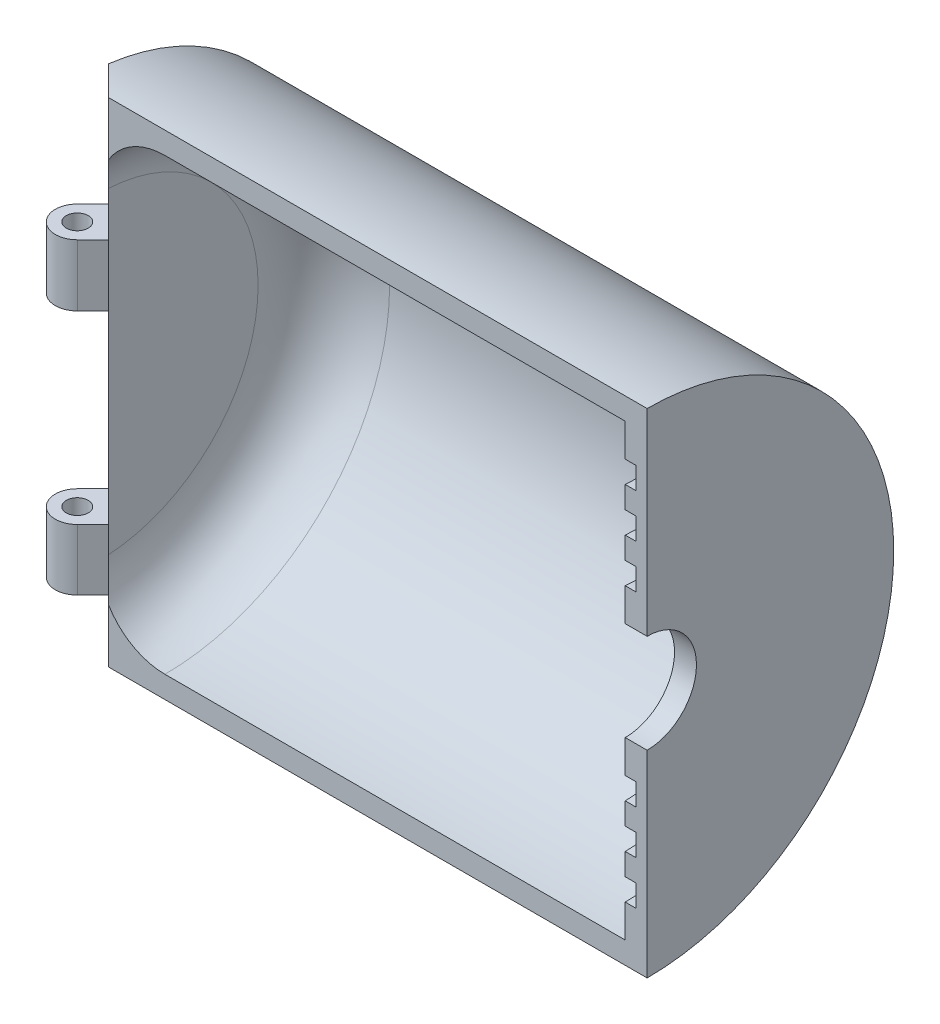
ISO-10303-21;
HEADER;
FILE_DESCRIPTION(('STEP AP214'),'2;1');
FILE_NAME('part.step','',(''),(''),'','','');
FILE_SCHEMA(('AUTOMOTIVE_DESIGN { 1 0 10303 214 1 1 1 1 }'));
ENDSEC;
DATA;
#1=APPLICATION_CONTEXT('core data for automotive mechanical design processes');
#2=APPLICATION_PROTOCOL_DEFINITION('international standard','automotive_design',2000,#1);
#3=PRODUCT_CONTEXT('',#1,'mechanical');
#4=PRODUCT('Part','Part','',(#3));
#5=PRODUCT_RELATED_PRODUCT_CATEGORY('part','',(#4));
#6=PRODUCT_DEFINITION_FORMATION('','',#4);
#7=PRODUCT_DEFINITION_CONTEXT('part definition',#1,'design');
#8=PRODUCT_DEFINITION('design','',#6,#7);
#9=PRODUCT_DEFINITION_SHAPE('','',#8);
#10=(LENGTH_UNIT() NAMED_UNIT(*) SI_UNIT(.MILLI.,.METRE.));
#11=(NAMED_UNIT(*) PLANE_ANGLE_UNIT() SI_UNIT($,.RADIAN.));
#12=(NAMED_UNIT(*) SI_UNIT($,.STERADIAN.) SOLID_ANGLE_UNIT());
#13=UNCERTAINTY_MEASURE_WITH_UNIT(LENGTH_MEASURE(1.E-05),#10,'distance_accuracy_value','');
#14=(GEOMETRIC_REPRESENTATION_CONTEXT(3) GLOBAL_UNCERTAINTY_ASSIGNED_CONTEXT((#13)) GLOBAL_UNIT_ASSIGNED_CONTEXT((#10,
#11,#12)) REPRESENTATION_CONTEXT('',''));
#15=CARTESIAN_POINT('',(0.,0.,0.));
#16=DIRECTION('',(0.,0.,1.));
#17=DIRECTION('',(1.,0.,0.));
#18=AXIS2_PLACEMENT_3D('',#15,#16,#17);
#19=CARTESIAN_POINT('',(-24.2928932188134,-11.25,0.707106781186545));
#20=DIRECTION('',(0.707106781186552,0.,0.707106781186543));
#21=DIRECTION('',(0.707106781186543,0.,-0.707106781186552));
#22=AXIS2_PLACEMENT_3D('',#19,#20,#21);
#23=PLANE('',#22);
#24=DIRECTION('',(-0.707106781186543,0.,0.707106781186552));
#25=VECTOR('',#24,1.);
#26=CARTESIAN_POINT('',(-23.5857864376269,-8.41492963527557,0.));
#27=LINE('',#26,#25);
#28=CARTESIAN_POINT('',(-23.5857864376269,-8.41492963527557,0.));
#29=VERTEX_POINT('',#28);
#30=CARTESIAN_POINT('',(-24.2928932188134,-8.41492963527557,0.707106781186551));
#31=VERTEX_POINT('',#30);
#32=EDGE_CURVE('E593',#29,#31,#27,.T.);
#33=ORIENTED_EDGE('',*,*,#32,.F.);
#34=DIRECTION('',(0.,1.,0.));
#35=VECTOR('',#34,1.);
#36=CARTESIAN_POINT('',(-23.5857864376269,-11.25,0.));
#37=LINE('',#36,#35);
#38=CARTESIAN_POINT('',(-23.5857864376269,-5.625,0.));
#39=VERTEX_POINT('',#38);
#40=EDGE_CURVE('E337',#29,#39,#37,.T.);
#41=ORIENTED_EDGE('',*,*,#40,.T.);
#42=DIRECTION('',(0.707106781186544,0.,-0.707106781186551));
#43=VECTOR('',#42,1.);
#44=CARTESIAN_POINT('',(-23.5857864376269,-5.625,0.));
#45=LINE('',#44,#43);
#46=CARTESIAN_POINT('',(-24.2928932188134,-5.625,0.70710678118655));
#47=VERTEX_POINT('',#46);
#48=EDGE_CURVE('E613',#47,#39,#45,.T.);
#49=ORIENTED_EDGE('',*,*,#48,.F.);
#50=DIRECTION('',(0.,1.,0.));
#51=VECTOR('',#50,1.);
#52=CARTESIAN_POINT('',(-24.2928932188134,-11.25,0.707106781186547));
#53=LINE('',#52,#51);
#54=EDGE_CURVE('E597',#31,#47,#53,.T.);
#55=ORIENTED_EDGE('',*,*,#54,.F.);
#56=EDGE_LOOP('',(#33,#41,#49,#55));
#57=FACE_BOUND('',#56,.T.);
#58=ADVANCED_FACE('F107',(#57),#23,.T.);
#59=CARTESIAN_POINT('',(-25.,-11.25,0.));
#60=DIRECTION('',(0.,1.,0.));
#61=DIRECTION('',(0.,0.,1.));
#62=AXIS2_PLACEMENT_3D('',#59,#60,#61);
#63=CYLINDRICAL_SURFACE('',#62,1.);
#64=CARTESIAN_POINT('',(-25.,-8.41492963527557,0.));
#65=DIRECTION('',(0.,1.,0.));
#66=DIRECTION('',(-1.,0.,0.));
#67=AXIS2_PLACEMENT_3D('',#64,#65,#66);
#68=CIRCLE('',#67,1.);
#69=CARTESIAN_POINT('',(-25.7071067811865,-8.41492963527557,-0.707106781186544));
#70=VERTEX_POINT('',#69);
#71=EDGE_CURVE('E704',#31,#70,#68,.F.);
#72=ORIENTED_EDGE('',*,*,#71,.F.);
#73=ORIENTED_EDGE('',*,*,#54,.T.);
#74=CARTESIAN_POINT('',(-25.,-5.625,0.));
#75=DIRECTION('',(0.,-1.,0.));
#76=DIRECTION('',(1.,0.,0.));
#77=AXIS2_PLACEMENT_3D('',#74,#75,#76);
#78=CIRCLE('',#77,1.);
#79=CARTESIAN_POINT('',(-25.7071067811865,-5.625,-0.707106781186544));
#80=VERTEX_POINT('',#79);
#81=EDGE_CURVE('E621',#80,#47,#78,.F.);
#82=ORIENTED_EDGE('',*,*,#81,.F.);
#83=DIRECTION('',(0.,1.,0.));
#84=VECTOR('',#83,1.);
#85=CARTESIAN_POINT('',(-25.7071067811865,-11.25,-0.707106781186544));
#86=LINE('',#85,#84);
#87=EDGE_CURVE('E343',#70,#80,#86,.T.);
#88=ORIENTED_EDGE('',*,*,#87,.F.);
#89=EDGE_LOOP('',(#72,#73,#82,#88));
#90=FACE_BOUND('',#89,.T.);
#91=ADVANCED_FACE('F584',(#90),#63,.T.);
#92=CARTESIAN_POINT('',(-25.,-11.25,-1.41421356237308));
#93=DIRECTION('',(-0.70710678118655,0.,-0.707106781186545));
#94=DIRECTION('',(-0.707106781186545,0.,0.70710678118655));
#95=AXIS2_PLACEMENT_3D('',#92,#93,#94);
#96=PLANE('',#95);
#97=DIRECTION('',(0.707106781186545,0.,-0.70710678118655));
#98=VECTOR('',#97,1.);
#99=CARTESIAN_POINT('',(-25.,-8.41492963527557,-1.41421356237308));
#100=LINE('',#99,#98);
#101=CARTESIAN_POINT('',(-25.,-8.41492963527557,-1.41421356237308));
#102=VERTEX_POINT('',#101);
#103=EDGE_CURVE('E1027',#70,#102,#100,.T.);
#104=ORIENTED_EDGE('',*,*,#103,.F.);
#105=ORIENTED_EDGE('',*,*,#87,.T.);
#106=DIRECTION('',(-0.707106781186545,0.,0.70710678118655));
#107=VECTOR('',#106,1.);
#108=CARTESIAN_POINT('',(-25.,-5.625,-1.41421356237308));
#109=LINE('',#108,#107);
#110=CARTESIAN_POINT('',(-25.,-5.625,-1.41421356237307));
#111=VERTEX_POINT('',#110);
#112=EDGE_CURVE('E481',#111,#80,#109,.T.);
#113=ORIENTED_EDGE('',*,*,#112,.F.);
#114=DIRECTION('',(0.,-1.,0.));
#115=VECTOR('',#114,1.);
#116=CARTESIAN_POINT('',(-25.,0.,-1.41421356237308));
#117=LINE('',#116,#115);
#118=EDGE_CURVE('E695',#111,#102,#117,.T.);
#119=ORIENTED_EDGE('',*,*,#118,.T.);
#120=EDGE_LOOP('',(#104,#105,#113,#119));
#121=FACE_BOUND('',#120,.T.);
#122=ADVANCED_FACE('F589',(#121),#96,.T.);
#123=CARTESIAN_POINT('',(-25.,-11.25,0.));
#124=DIRECTION('',(0.,1.,0.));
#125=DIRECTION('',(0.,0.,1.));
#126=AXIS2_PLACEMENT_3D('',#123,#124,#125);
#127=CYLINDRICAL_SURFACE('',#126,0.499999999999999);
#128=CARTESIAN_POINT('',(-25.,-8.41492963527557,0.));
#129=DIRECTION('',(0.,1.,0.));
#130=DIRECTION('',(-1.,0.,0.));
#131=AXIS2_PLACEMENT_3D('',#128,#129,#130);
#132=CIRCLE('',#131,0.499999999999999);
#133=CARTESIAN_POINT('',(-25.5,-8.41492963527557,0.));
#134=VERTEX_POINT('',#133);
#135=EDGE_CURVE('E1026',#134,#134,#132,.F.);
#136=ORIENTED_EDGE('',*,*,#135,.T.);
#137=EDGE_LOOP('',(#136));
#138=FACE_BOUND('',#137,.T.);
#139=CARTESIAN_POINT('',(-25.,-5.625,0.));
#140=DIRECTION('',(0.,-1.,0.));
#141=DIRECTION('',(1.,0.,0.));
#142=AXIS2_PLACEMENT_3D('',#139,#140,#141);
#143=CIRCLE('',#142,0.499999999999999);
#144=CARTESIAN_POINT('',(-24.5,-5.625,0.));
#145=VERTEX_POINT('',#144);
#146=EDGE_CURVE('E478',#145,#145,#143,.F.);
#147=ORIENTED_EDGE('',*,*,#146,.T.);
#148=EDGE_LOOP('',(#147));
#149=FACE_BOUND('',#148,.T.);
#150=ADVANCED_FACE('F658',(#138,#149),#127,.F.);
#151=CARTESIAN_POINT('',(-23.5857864376269,-11.25,0.));
#152=DIRECTION('',(0.707106781186545,0.,-0.70710678118655));
#153=DIRECTION('',(-0.70710678118655,0.,-0.707106781186545));
#154=AXIS2_PLACEMENT_3D('',#151,#152,#153);
#155=PLANE('',#154);
#156=DIRECTION('',(0.707106781186552,0.,0.707106781186543));
#157=VECTOR('',#156,1.);
#158=CARTESIAN_POINT('',(-52.2236110756823,-8.41492963527557,-28.637824638055));
#159=LINE('',#158,#157);
#160=CARTESIAN_POINT('',(-23.7637925720578,-8.41492963527557,-0.178006134430825));
#161=VERTEX_POINT('',#160);
#162=EDGE_CURVE('E600',#161,#29,#159,.T.);
#163=ORIENTED_EDGE('',*,*,#162,.F.);
#164=CARTESIAN_POINT('',(-23.7637925720578,-8.41492963527557,-0.178006134430822));
#165=CARTESIAN_POINT('',(-23.7875162474543,-8.35821185902782,-0.201729809827337));
#166=CARTESIAN_POINT('',(-23.8097180122118,-8.30024924533098,-0.223931574584881));
#167=CARTESIAN_POINT('',(-23.8508458839773,-8.18197512658704,-0.265059446350391));
#168=CARTESIAN_POINT('',(-23.8697686582079,-8.12166130713464,-0.283982220580968));
#169=CARTESIAN_POINT('',(-23.9203867584202,-7.94049959531988,-0.334600320793326));
#170=CARTESIAN_POINT('',(-23.9470817069689,-7.81670941605846,-0.361295269341987));
#171=CARTESIAN_POINT('',(-23.9771562070904,-7.61685209847112,-0.391369769463457));
#172=CARTESIAN_POINT('',(-23.985612802323,-7.54223920454232,-0.399826364696103));
#173=CARTESIAN_POINT('',(-23.9970784509074,-7.391168101616,-0.411292013280502));
#174=CARTESIAN_POINT('',(-24.0000126193751,-7.31469857324764,-0.4142261817482));
#175=CARTESIAN_POINT('',(-24.,-7.2381577162111,-0.414213562373092));
#176=B_SPLINE_CURVE_WITH_KNOTS('',3,(#164,#165,#166,#167,#168,#169,#170,#171,#172,#173,#174,
#175),.UNSPECIFIED.,.F.,.F.,(4,2,2,2,2,4),(0.,0.197588049259009,0.39537576450178,
0.781542917532636,1.00787606383459,1.23725680586273),.UNSPECIFIED.);
#177=CARTESIAN_POINT('',(-24.,-7.23815771621109,-0.414213562373091));
#178=VERTEX_POINT('',#177);
#179=EDGE_CURVE('E489',#161,#178,#176,.T.);
#180=ORIENTED_EDGE('',*,*,#179,.T.);
#181=DIRECTION('',(0.,-1.,0.));
#182=VECTOR('',#181,1.);
#183=CARTESIAN_POINT('',(-24.,0.,-0.414213562373092));
#184=LINE('',#183,#182);
#185=CARTESIAN_POINT('',(-24.,-5.625,-0.414213562373086));
#186=VERTEX_POINT('',#185);
#187=EDGE_CURVE('E349',#186,#178,#184,.T.);
#188=ORIENTED_EDGE('',*,*,#187,.F.);
#189=DIRECTION('',(0.707106781186551,0.,0.707106781186544));
#190=VECTOR('',#189,1.);
#191=CARTESIAN_POINT('',(-39.4956890143243,-5.625,-15.9099025766972));
#192=LINE('',#191,#190);
#193=EDGE_CURVE('E608',#186,#39,#192,.T.);
#194=ORIENTED_EDGE('',*,*,#193,.T.);
#195=ORIENTED_EDGE('',*,*,#40,.F.);
#196=EDGE_LOOP('',(#163,#180,#188,#194,#195));
#197=FACE_BOUND('',#196,.T.);
#198=ADVANCED_FACE('F504',(#197),#155,.T.);
#199=CARTESIAN_POINT('',(1.,0.,0.));
#200=DIRECTION('',(0.,0.,1.));
#201=DIRECTION('',(1.,0.,0.));
#202=AXIS2_PLACEMENT_3D('',#199,#200,#201);
#203=PLANE('',#202);
#204=CARTESIAN_POINT('',(-23.5857864376269,-11.25,0.));
#205=VERTEX_POINT('',#204);
#206=CARTESIAN_POINT('',(-23.5857864376269,-8.77108793269311,0.));
#207=VERTEX_POINT('',#206);
#208=EDGE_CURVE('E130',#205,#207,#37,.T.);
#209=ORIENTED_EDGE('',*,*,#208,.F.);
#210=DIRECTION('',(1.,0.,0.));
#211=VECTOR('',#210,1.);
#212=CARTESIAN_POINT('',(-24.,-11.25,0.));
#213=LINE('',#212,#211);
#214=CARTESIAN_POINT('',(1.,-11.25,0.));
#215=VERTEX_POINT('',#214);
#216=EDGE_CURVE('E363',#205,#215,#213,.T.);
#217=ORIENTED_EDGE('',*,*,#216,.T.);
#218=DIRECTION('',(0.,1.,0.));
#219=VECTOR('',#218,1.);
#220=CARTESIAN_POINT('',(1.,0.,0.));
#221=LINE('',#220,#219);
#222=CARTESIAN_POINT('',(1.,-2.25,0.));
#223=VERTEX_POINT('',#222);
#224=EDGE_CURVE('E447',#215,#223,#221,.T.);
#225=ORIENTED_EDGE('',*,*,#224,.T.);
#226=DIRECTION('',(-1.,0.,0.));
#227=VECTOR('',#226,1.);
#228=CARTESIAN_POINT('',(1.,-2.25,0.));
#229=LINE('',#228,#227);
#230=CARTESIAN_POINT('',(0.,-2.25,0.));
#231=VERTEX_POINT('',#230);
#232=EDGE_CURVE('E465',#223,#231,#229,.T.);
#233=ORIENTED_EDGE('',*,*,#232,.T.);
#234=DIRECTION('',(0.,1.,0.));
#235=VECTOR('',#234,1.);
#236=CARTESIAN_POINT('',(0.,0.,0.));
#237=LINE('',#236,#235);
#238=CARTESIAN_POINT('',(0.,-3.75,0.));
#239=VERTEX_POINT('',#238);
#240=EDGE_CURVE('E454',#239,#231,#237,.T.);
#241=ORIENTED_EDGE('',*,*,#240,.F.);
#242=DIRECTION('',(-1.,0.,0.));
#243=VECTOR('',#242,1.);
#244=CARTESIAN_POINT('',(0.5,-3.75,0.));
#245=LINE('',#244,#243);
#246=CARTESIAN_POINT('',(0.5,-3.75,0.));
#247=VERTEX_POINT('',#246);
#248=EDGE_CURVE('E438',#247,#239,#245,.T.);
#249=ORIENTED_EDGE('',*,*,#248,.F.);
#250=DIRECTION('',(0.,1.,0.));
#251=VECTOR('',#250,1.);
#252=CARTESIAN_POINT('',(0.5,0.,0.));
#253=LINE('',#252,#251);
#254=CARTESIAN_POINT('',(0.5,-4.75,0.));
#255=VERTEX_POINT('',#254);
#256=EDGE_CURVE('E425',#255,#247,#253,.T.);
#257=ORIENTED_EDGE('',*,*,#256,.F.);
#258=DIRECTION('',(-1.,0.,0.));
#259=VECTOR('',#258,1.);
#260=CARTESIAN_POINT('',(0.5,-4.75,0.));
#261=LINE('',#260,#259);
#262=CARTESIAN_POINT('',(0.,-4.75,0.));
#263=VERTEX_POINT('',#262);
#264=EDGE_CURVE('E440',#255,#263,#261,.T.);
#265=ORIENTED_EDGE('',*,*,#264,.T.);
#266=CARTESIAN_POINT('',(0.,-5.75,0.));
#267=VERTEX_POINT('',#266);
#268=EDGE_CURVE('E736',#267,#263,#237,.T.);
#269=ORIENTED_EDGE('',*,*,#268,.F.);
#270=DIRECTION('',(-1.,0.,0.));
#271=VECTOR('',#270,1.);
#272=CARTESIAN_POINT('',(0.5,-5.75,0.));
#273=LINE('',#272,#271);
#274=CARTESIAN_POINT('',(0.5,-5.75,0.));
#275=VERTEX_POINT('',#274);
#276=EDGE_CURVE('E412',#275,#267,#273,.T.);
#277=ORIENTED_EDGE('',*,*,#276,.F.);
#278=DIRECTION('',(0.,1.,0.));
#279=VECTOR('',#278,1.);
#280=CARTESIAN_POINT('',(0.5,0.,0.));
#281=LINE('',#280,#279);
#282=CARTESIAN_POINT('',(0.5,-6.75,0.));
#283=VERTEX_POINT('',#282);
#284=EDGE_CURVE('E399',#283,#275,#281,.T.);
#285=ORIENTED_EDGE('',*,*,#284,.F.);
#286=DIRECTION('',(-1.,0.,0.));
#287=VECTOR('',#286,1.);
#288=CARTESIAN_POINT('',(0.5,-6.75,0.));
#289=LINE('',#288,#287);
#290=CARTESIAN_POINT('',(0.,-6.75,0.));
#291=VERTEX_POINT('',#290);
#292=EDGE_CURVE('E414',#283,#291,#289,.T.);
#293=ORIENTED_EDGE('',*,*,#292,.T.);
#294=CARTESIAN_POINT('',(0.,-7.75,0.));
#295=VERTEX_POINT('',#294);
#296=EDGE_CURVE('E459',#295,#291,#237,.T.);
#297=ORIENTED_EDGE('',*,*,#296,.F.);
#298=DIRECTION('',(-1.,0.,0.));
#299=VECTOR('',#298,1.);
#300=CARTESIAN_POINT('',(0.5,-7.75,0.));
#301=LINE('',#300,#299);
#302=CARTESIAN_POINT('',(0.5,-7.75,0.));
#303=VERTEX_POINT('',#302);
#304=EDGE_CURVE('E386',#303,#295,#301,.T.);
#305=ORIENTED_EDGE('',*,*,#304,.F.);
#306=DIRECTION('',(0.,1.,0.));
#307=VECTOR('',#306,1.);
#308=CARTESIAN_POINT('',(0.5,0.,0.));
#309=LINE('',#308,#307);
#310=CARTESIAN_POINT('',(0.5,-8.75,0.));
#311=VERTEX_POINT('',#310);
#312=EDGE_CURVE('E373',#311,#303,#309,.T.);
#313=ORIENTED_EDGE('',*,*,#312,.F.);
#314=DIRECTION('',(-1.,0.,0.));
#315=VECTOR('',#314,1.);
#316=CARTESIAN_POINT('',(0.5,-8.75,0.));
#317=LINE('',#316,#315);
#318=CARTESIAN_POINT('',(0.,-8.75,0.));
#319=VERTEX_POINT('',#318);
#320=EDGE_CURVE('E388',#311,#319,#317,.T.);
#321=ORIENTED_EDGE('',*,*,#320,.T.);
#322=CARTESIAN_POINT('',(0.,-10.25,0.));
#323=VERTEX_POINT('',#322);
#324=EDGE_CURVE('E455',#323,#319,#237,.T.);
#325=ORIENTED_EDGE('',*,*,#324,.F.);
#326=DIRECTION('',(1.,0.,0.));
#327=VECTOR('',#326,1.);
#328=CARTESIAN_POINT('',(-24.,-10.25,0.));
#329=LINE('',#328,#327);
#330=CARTESIAN_POINT('',(-21.,-10.25,0.));
#331=VERTEX_POINT('',#330);
#332=EDGE_CURVE('E357',#331,#323,#329,.T.);
#333=ORIENTED_EDGE('',*,*,#332,.F.);
#334=CARTESIAN_POINT('',(-21.,-7.25,0.));
#335=DIRECTION('',(0.,0.,1.));
#336=DIRECTION('',(1.,0.,0.));
#337=AXIS2_PLACEMENT_3D('',#334,#335,#336);
#338=CIRCLE('',#337,3.);
#339=EDGE_CURVE('E677',#331,#207,#338,.F.);
#340=ORIENTED_EDGE('',*,*,#339,.T.);
#341=EDGE_LOOP('',(#209,#217,#225,#233,#241,#249,#257,#265,#269,#277,#285,#293,#297,#305,#313,
#321,#325,#333,#340));
#342=FACE_BOUND('',#341,.T.);
#343=ADVANCED_FACE('F574',(#342),#203,.T.);
#344=CARTESIAN_POINT('',(-23.5857864376269,8.7710879326931,0.));
#345=VERTEX_POINT('',#344);
#346=CARTESIAN_POINT('',(-23.5857864376269,11.25,0.));
#347=VERTEX_POINT('',#346);
#348=EDGE_CURVE('E122',#345,#347,#37,.T.);
#349=ORIENTED_EDGE('',*,*,#348,.F.);
#350=CARTESIAN_POINT('',(-21.,7.25,0.));
#351=DIRECTION('',(0.,0.,1.));
#352=DIRECTION('',(1.,0.,0.));
#353=AXIS2_PLACEMENT_3D('',#350,#351,#352);
#354=CIRCLE('',#353,3.);
#355=CARTESIAN_POINT('',(-21.,10.25,0.));
#356=VERTEX_POINT('',#355);
#357=EDGE_CURVE('E12',#345,#356,#354,.F.);
#358=ORIENTED_EDGE('',*,*,#357,.T.);
#359=DIRECTION('',(1.,0.,0.));
#360=VECTOR('',#359,1.);
#361=CARTESIAN_POINT('',(-24.,10.25,0.));
#362=LINE('',#361,#360);
#363=CARTESIAN_POINT('',(0.,10.25,0.));
#364=VERTEX_POINT('',#363);
#365=EDGE_CURVE('E358',#356,#364,#362,.T.);
#366=ORIENTED_EDGE('',*,*,#365,.T.);
#367=CARTESIAN_POINT('',(0.,8.75,0.));
#368=VERTEX_POINT('',#367);
#369=EDGE_CURVE('E462',#368,#364,#237,.T.);
#370=ORIENTED_EDGE('',*,*,#369,.F.);
#371=DIRECTION('',(-1.,0.,0.));
#372=VECTOR('',#371,1.);
#373=CARTESIAN_POINT('',(0.5,8.75,0.));
#374=LINE('',#373,#372);
#375=CARTESIAN_POINT('',(0.5,8.75,0.));
#376=VERTEX_POINT('',#375);
#377=EDGE_CURVE('E378',#376,#368,#374,.T.);
#378=ORIENTED_EDGE('',*,*,#377,.F.);
#379=DIRECTION('',(0.,1.,0.));
#380=VECTOR('',#379,1.);
#381=CARTESIAN_POINT('',(0.5,0.,0.));
#382=LINE('',#381,#380);
#383=CARTESIAN_POINT('',(0.5,7.75,0.));
#384=VERTEX_POINT('',#383);
#385=EDGE_CURVE('E366',#384,#376,#382,.T.);
#386=ORIENTED_EDGE('',*,*,#385,.F.);
#387=DIRECTION('',(-1.,0.,0.));
#388=VECTOR('',#387,1.);
#389=CARTESIAN_POINT('',(0.5,7.75,0.));
#390=LINE('',#389,#388);
#391=CARTESIAN_POINT('',(0.,7.75,0.));
#392=VERTEX_POINT('',#391);
#393=EDGE_CURVE('E382',#384,#392,#390,.T.);
#394=ORIENTED_EDGE('',*,*,#393,.T.);
#395=CARTESIAN_POINT('',(0.,6.75,0.));
#396=VERTEX_POINT('',#395);
#397=EDGE_CURVE('E732',#396,#392,#237,.T.);
#398=ORIENTED_EDGE('',*,*,#397,.F.);
#399=DIRECTION('',(-1.,0.,0.));
#400=VECTOR('',#399,1.);
#401=CARTESIAN_POINT('',(0.5,6.75,0.));
#402=LINE('',#401,#400);
#403=CARTESIAN_POINT('',(0.5,6.75,0.));
#404=VERTEX_POINT('',#403);
#405=EDGE_CURVE('E404',#404,#396,#402,.T.);
#406=ORIENTED_EDGE('',*,*,#405,.F.);
#407=DIRECTION('',(0.,1.,0.));
#408=VECTOR('',#407,1.);
#409=CARTESIAN_POINT('',(0.5,0.,0.));
#410=LINE('',#409,#408);
#411=CARTESIAN_POINT('',(0.5,5.75,0.));
#412=VERTEX_POINT('',#411);
#413=EDGE_CURVE('E392',#412,#404,#410,.T.);
#414=ORIENTED_EDGE('',*,*,#413,.F.);
#415=DIRECTION('',(-1.,0.,0.));
#416=VECTOR('',#415,1.);
#417=CARTESIAN_POINT('',(0.5,5.75,0.));
#418=LINE('',#417,#416);
#419=CARTESIAN_POINT('',(0.,5.75,0.));
#420=VERTEX_POINT('',#419);
#421=EDGE_CURVE('E408',#412,#420,#418,.T.);
#422=ORIENTED_EDGE('',*,*,#421,.T.);
#423=CARTESIAN_POINT('',(0.,4.75,0.));
#424=VERTEX_POINT('',#423);
#425=EDGE_CURVE('E734',#424,#420,#237,.T.);
#426=ORIENTED_EDGE('',*,*,#425,.F.);
#427=DIRECTION('',(-1.,0.,0.));
#428=VECTOR('',#427,1.);
#429=CARTESIAN_POINT('',(0.5,4.75,0.));
#430=LINE('',#429,#428);
#431=CARTESIAN_POINT('',(0.5,4.75,0.));
#432=VERTEX_POINT('',#431);
#433=EDGE_CURVE('E430',#432,#424,#430,.T.);
#434=ORIENTED_EDGE('',*,*,#433,.F.);
#435=DIRECTION('',(0.,1.,0.));
#436=VECTOR('',#435,1.);
#437=CARTESIAN_POINT('',(0.5,0.,0.));
#438=LINE('',#437,#436);
#439=CARTESIAN_POINT('',(0.5,3.75,0.));
#440=VERTEX_POINT('',#439);
#441=EDGE_CURVE('E418',#440,#432,#438,.T.);
#442=ORIENTED_EDGE('',*,*,#441,.F.);
#443=DIRECTION('',(-1.,0.,0.));
#444=VECTOR('',#443,1.);
#445=CARTESIAN_POINT('',(0.5,3.75,0.));
#446=LINE('',#445,#444);
#447=CARTESIAN_POINT('',(0.,3.75,0.));
#448=VERTEX_POINT('',#447);
#449=EDGE_CURVE('E434',#440,#448,#446,.T.);
#450=ORIENTED_EDGE('',*,*,#449,.T.);
#451=CARTESIAN_POINT('',(0.,2.25,0.));
#452=VERTEX_POINT('',#451);
#453=EDGE_CURVE('E448',#452,#448,#237,.T.);
#454=ORIENTED_EDGE('',*,*,#453,.F.);
#455=DIRECTION('',(-1.,0.,0.));
#456=VECTOR('',#455,1.);
#457=CARTESIAN_POINT('',(1.,2.25,0.));
#458=LINE('',#457,#456);
#459=CARTESIAN_POINT('',(1.,2.25,0.));
#460=VERTEX_POINT('',#459);
#461=EDGE_CURVE('E463',#460,#452,#458,.T.);
#462=ORIENTED_EDGE('',*,*,#461,.F.);
#463=CARTESIAN_POINT('',(1.,11.25,0.));
#464=VERTEX_POINT('',#463);
#465=EDGE_CURVE('E451',#460,#464,#221,.T.);
#466=ORIENTED_EDGE('',*,*,#465,.T.);
#467=DIRECTION('',(1.,0.,0.));
#468=VECTOR('',#467,1.);
#469=CARTESIAN_POINT('',(-24.,11.25,0.));
#470=LINE('',#469,#468);
#471=EDGE_CURVE('E361',#347,#464,#470,.T.);
#472=ORIENTED_EDGE('',*,*,#471,.F.);
#473=EDGE_LOOP('',(#349,#358,#366,#370,#378,#386,#394,#398,#406,#414,#422,#426,#434,#442,#450,
#454,#462,#466,#472));
#474=FACE_BOUND('',#473,.T.);
#475=ADVANCED_FACE('F572',(#474),#203,.T.);
#476=CARTESIAN_POINT('',(0.,0.,0.));
#477=DIRECTION('',(1.,0.,0.));
#478=DIRECTION('',(0.,0.,-1.));
#479=AXIS2_PLACEMENT_3D('',#476,#477,#478);
#480=PLANE('',#479);
#481=CARTESIAN_POINT('',(0.,0.,0.));
#482=DIRECTION('',(-1.,0.,0.));
#483=DIRECTION('',(0.,0.,1.));
#484=AXIS2_PLACEMENT_3D('',#481,#482,#483);
#485=CIRCLE('',#484,5.75);
#486=EDGE_CURVE('E396',#420,#267,#485,.T.);
#487=ORIENTED_EDGE('',*,*,#486,.T.);
#488=ORIENTED_EDGE('',*,*,#268,.T.);
#489=CARTESIAN_POINT('',(0.,0.,0.));
#490=DIRECTION('',(-1.,0.,0.));
#491=DIRECTION('',(0.,0.,1.));
#492=AXIS2_PLACEMENT_3D('',#489,#490,#491);
#493=CIRCLE('',#492,4.75);
#494=EDGE_CURVE('E411',#424,#263,#493,.T.);
#495=ORIENTED_EDGE('',*,*,#494,.F.);
#496=ORIENTED_EDGE('',*,*,#425,.T.);
#497=EDGE_LOOP('',(#487,#488,#495,#496));
#498=FACE_BOUND('',#497,.T.);
#499=ADVANCED_FACE('F570',(#498),#480,.F.);
#500=ORIENTED_EDGE('',*,*,#296,.T.);
#501=CARTESIAN_POINT('',(0.,0.,0.));
#502=DIRECTION('',(-1.,0.,0.));
#503=DIRECTION('',(0.,0.,1.));
#504=AXIS2_PLACEMENT_3D('',#501,#502,#503);
#505=CIRCLE('',#504,6.75);
#506=EDGE_CURVE('E385',#396,#291,#505,.T.);
#507=ORIENTED_EDGE('',*,*,#506,.F.);
#508=ORIENTED_EDGE('',*,*,#397,.T.);
#509=CARTESIAN_POINT('',(0.,0.,0.));
#510=DIRECTION('',(-1.,0.,0.));
#511=DIRECTION('',(0.,0.,1.));
#512=AXIS2_PLACEMENT_3D('',#509,#510,#511);
#513=CIRCLE('',#512,7.75);
#514=EDGE_CURVE('E370',#392,#295,#513,.T.);
#515=ORIENTED_EDGE('',*,*,#514,.T.);
#516=EDGE_LOOP('',(#500,#507,#508,#515));
#517=FACE_BOUND('',#516,.T.);
#518=ADVANCED_FACE('F580',(#517),#480,.F.);
#519=CARTESIAN_POINT('',(0.,0.,0.));
#520=DIRECTION('',(-1.,0.,0.));
#521=DIRECTION('',(0.,0.,1.));
#522=AXIS2_PLACEMENT_3D('',#519,#520,#521);
#523=CIRCLE('',#522,3.75);
#524=EDGE_CURVE('E422',#448,#239,#523,.T.);
#525=ORIENTED_EDGE('',*,*,#524,.T.);
#526=ORIENTED_EDGE('',*,*,#240,.T.);
#527=CARTESIAN_POINT('',(0.,0.,0.));
#528=DIRECTION('',(1.,0.,0.));
#529=DIRECTION('',(0.,0.,-1.));
#530=AXIS2_PLACEMENT_3D('',#527,#528,#529);
#531=CIRCLE('',#530,2.25);
#532=EDGE_CURVE('E437',#231,#452,#531,.T.);
#533=ORIENTED_EDGE('',*,*,#532,.T.);
#534=ORIENTED_EDGE('',*,*,#453,.T.);
#535=EDGE_LOOP('',(#525,#526,#533,#534));
#536=FACE_BOUND('',#535,.T.);
#537=ADVANCED_FACE('F571',(#536),#480,.F.);
#538=CARTESIAN_POINT('',(1.,0.,0.));
#539=DIRECTION('',(-1.,0.,0.));
#540=DIRECTION('',(0.,0.,1.));
#541=AXIS2_PLACEMENT_3D('',#538,#539,#540);
#542=CYLINDRICAL_SURFACE('',#541,2.25);
#543=ORIENTED_EDGE('',*,*,#532,.F.);
#544=ORIENTED_EDGE('',*,*,#232,.F.);
#545=CARTESIAN_POINT('',(1.,0.,0.));
#546=DIRECTION('',(1.,0.,0.));
#547=DIRECTION('',(0.,0.,-1.));
#548=AXIS2_PLACEMENT_3D('',#545,#546,#547);
#549=CIRCLE('',#548,2.25);
#550=EDGE_CURVE('E444',#223,#460,#549,.T.);
#551=ORIENTED_EDGE('',*,*,#550,.T.);
#552=ORIENTED_EDGE('',*,*,#461,.T.);
#553=EDGE_LOOP('',(#543,#544,#551,#552));
#554=FACE_BOUND('',#553,.T.);
#555=ADVANCED_FACE('F565',(#554),#542,.F.);
#556=CARTESIAN_POINT('',(1.,0.,0.));
#557=DIRECTION('',(1.,0.,0.));
#558=DIRECTION('',(0.,0.,-1.));
#559=AXIS2_PLACEMENT_3D('',#556,#557,#558);
#560=PLANE('',#559);
#561=ORIENTED_EDGE('',*,*,#550,.F.);
#562=ORIENTED_EDGE('',*,*,#224,.F.);
#563=CARTESIAN_POINT('',(1.,0.,0.));
#564=DIRECTION('',(1.,0.,0.));
#565=DIRECTION('',(0.,0.,-1.));
#566=AXIS2_PLACEMENT_3D('',#563,#564,#565);
#567=CIRCLE('',#566,11.25);
#568=EDGE_CURVE('E354',#215,#464,#567,.T.);
#569=ORIENTED_EDGE('',*,*,#568,.T.);
#570=ORIENTED_EDGE('',*,*,#465,.F.);
#571=EDGE_LOOP('',(#561,#562,#569,#570));
#572=FACE_BOUND('',#571,.T.);
#573=ADVANCED_FACE('F562',(#572),#560,.T.);
#574=ORIENTED_EDGE('',*,*,#324,.T.);
#575=CARTESIAN_POINT('',(0.,0.,0.));
#576=DIRECTION('',(-1.,0.,0.));
#577=DIRECTION('',(0.,0.,1.));
#578=AXIS2_PLACEMENT_3D('',#575,#576,#577);
#579=CIRCLE('',#578,8.75);
#580=EDGE_CURVE('E360',#368,#319,#579,.T.);
#581=ORIENTED_EDGE('',*,*,#580,.F.);
#582=ORIENTED_EDGE('',*,*,#369,.T.);
#583=CARTESIAN_POINT('',(0.,0.,0.));
#584=DIRECTION('',(1.,0.,0.));
#585=DIRECTION('',(0.,0.,-1.));
#586=AXIS2_PLACEMENT_3D('',#583,#584,#585);
#587=CIRCLE('',#586,10.25);
#588=EDGE_CURVE('E458',#323,#364,#587,.T.);
#589=ORIENTED_EDGE('',*,*,#588,.F.);
#590=EDGE_LOOP('',(#574,#581,#582,#589));
#591=FACE_BOUND('',#590,.T.);
#592=ADVANCED_FACE('F557',(#591),#480,.F.);
#593=CARTESIAN_POINT('',(0.5,0.,0.));
#594=DIRECTION('',(-1.,0.,0.));
#595=DIRECTION('',(0.,0.,1.));
#596=AXIS2_PLACEMENT_3D('',#593,#594,#595);
#597=CYLINDRICAL_SURFACE('',#596,3.75);
#598=ORIENTED_EDGE('',*,*,#524,.F.);
#599=ORIENTED_EDGE('',*,*,#449,.F.);
#600=CARTESIAN_POINT('',(0.5,0.,0.));
#601=DIRECTION('',(-1.,0.,0.));
#602=DIRECTION('',(0.,0.,1.));
#603=AXIS2_PLACEMENT_3D('',#600,#601,#602);
#604=CIRCLE('',#603,3.75);
#605=EDGE_CURVE('E428',#440,#247,#604,.T.);
#606=ORIENTED_EDGE('',*,*,#605,.T.);
#607=ORIENTED_EDGE('',*,*,#248,.T.);
#608=EDGE_LOOP('',(#598,#599,#606,#607));
#609=FACE_BOUND('',#608,.T.);
#610=ADVANCED_FACE('F554',(#609),#597,.T.);
#611=CARTESIAN_POINT('',(0.5,0.,0.));
#612=DIRECTION('',(-1.,0.,0.));
#613=DIRECTION('',(0.,0.,1.));
#614=AXIS2_PLACEMENT_3D('',#611,#612,#613);
#615=CYLINDRICAL_SURFACE('',#614,4.75);
#616=ORIENTED_EDGE('',*,*,#494,.T.);
#617=ORIENTED_EDGE('',*,*,#264,.F.);
#618=CARTESIAN_POINT('',(0.5,0.,0.));
#619=DIRECTION('',(-1.,0.,0.));
#620=DIRECTION('',(0.,0.,1.));
#621=AXIS2_PLACEMENT_3D('',#618,#619,#620);
#622=CIRCLE('',#621,4.75);
#623=EDGE_CURVE('E421',#432,#255,#622,.T.);
#624=ORIENTED_EDGE('',*,*,#623,.F.);
#625=ORIENTED_EDGE('',*,*,#433,.T.);
#626=EDGE_LOOP('',(#616,#617,#624,#625));
#627=FACE_BOUND('',#626,.T.);
#628=ADVANCED_FACE('F552',(#627),#615,.F.);
#629=CARTESIAN_POINT('',(0.5,0.,0.));
#630=DIRECTION('',(-1.,0.,0.));
#631=DIRECTION('',(0.,0.,1.));
#632=AXIS2_PLACEMENT_3D('',#629,#630,#631);
#633=PLANE('',#632);
#634=ORIENTED_EDGE('',*,*,#441,.T.);
#635=ORIENTED_EDGE('',*,*,#623,.T.);
#636=ORIENTED_EDGE('',*,*,#256,.T.);
#637=ORIENTED_EDGE('',*,*,#605,.F.);
#638=EDGE_LOOP('',(#634,#635,#636,#637));
#639=FACE_BOUND('',#638,.T.);
#640=ADVANCED_FACE('F535',(#639),#633,.T.);
#641=CARTESIAN_POINT('',(0.5,0.,0.));
#642=DIRECTION('',(-1.,0.,0.));
#643=DIRECTION('',(0.,0.,1.));
#644=AXIS2_PLACEMENT_3D('',#641,#642,#643);
#645=CYLINDRICAL_SURFACE('',#644,7.75);
#646=ORIENTED_EDGE('',*,*,#514,.F.);
#647=ORIENTED_EDGE('',*,*,#393,.F.);
#648=CARTESIAN_POINT('',(0.5,0.,0.));
#649=DIRECTION('',(-1.,0.,0.));
#650=DIRECTION('',(0.,0.,1.));
#651=AXIS2_PLACEMENT_3D('',#648,#649,#650);
#652=CIRCLE('',#651,7.75);
#653=EDGE_CURVE('E376',#384,#303,#652,.T.);
#654=ORIENTED_EDGE('',*,*,#653,.T.);
#655=ORIENTED_EDGE('',*,*,#304,.T.);
#656=EDGE_LOOP('',(#646,#647,#654,#655));
#657=FACE_BOUND('',#656,.T.);
#658=ADVANCED_FACE('F532',(#657),#645,.T.);
#659=CARTESIAN_POINT('',(0.5,0.,0.));
#660=DIRECTION('',(-1.,0.,0.));
#661=DIRECTION('',(0.,0.,1.));
#662=AXIS2_PLACEMENT_3D('',#659,#660,#661);
#663=CYLINDRICAL_SURFACE('',#662,8.75);
#664=ORIENTED_EDGE('',*,*,#580,.T.);
#665=ORIENTED_EDGE('',*,*,#320,.F.);
#666=CARTESIAN_POINT('',(0.5,0.,0.));
#667=DIRECTION('',(-1.,0.,0.));
#668=DIRECTION('',(0.,0.,1.));
#669=AXIS2_PLACEMENT_3D('',#666,#667,#668);
#670=CIRCLE('',#669,8.75);
#671=EDGE_CURVE('E369',#376,#311,#670,.T.);
#672=ORIENTED_EDGE('',*,*,#671,.F.);
#673=ORIENTED_EDGE('',*,*,#377,.T.);
#674=EDGE_LOOP('',(#664,#665,#672,#673));
#675=FACE_BOUND('',#674,.T.);
#676=ADVANCED_FACE('F530',(#675),#663,.F.);
#677=CARTESIAN_POINT('',(0.5,0.,0.));
#678=DIRECTION('',(-1.,0.,0.));
#679=DIRECTION('',(0.,0.,1.));
#680=AXIS2_PLACEMENT_3D('',#677,#678,#679);
#681=PLANE('',#680);
#682=ORIENTED_EDGE('',*,*,#385,.T.);
#683=ORIENTED_EDGE('',*,*,#671,.T.);
#684=ORIENTED_EDGE('',*,*,#312,.T.);
#685=ORIENTED_EDGE('',*,*,#653,.F.);
#686=EDGE_LOOP('',(#682,#683,#684,#685));
#687=FACE_BOUND('',#686,.T.);
#688=ADVANCED_FACE('F526',(#687),#681,.T.);
#689=CARTESIAN_POINT('',(0.5,0.,0.));
#690=DIRECTION('',(-1.,0.,0.));
#691=DIRECTION('',(0.,0.,1.));
#692=AXIS2_PLACEMENT_3D('',#689,#690,#691);
#693=CYLINDRICAL_SURFACE('',#692,5.75);
#694=ORIENTED_EDGE('',*,*,#486,.F.);
#695=ORIENTED_EDGE('',*,*,#421,.F.);
#696=CARTESIAN_POINT('',(0.5,0.,0.));
#697=DIRECTION('',(-1.,0.,0.));
#698=DIRECTION('',(0.,0.,1.));
#699=AXIS2_PLACEMENT_3D('',#696,#697,#698);
#700=CIRCLE('',#699,5.75);
#701=EDGE_CURVE('E402',#412,#275,#700,.T.);
#702=ORIENTED_EDGE('',*,*,#701,.T.);
#703=ORIENTED_EDGE('',*,*,#276,.T.);
#704=EDGE_LOOP('',(#694,#695,#702,#703));
#705=FACE_BOUND('',#704,.T.);
#706=ADVANCED_FACE('F529',(#705),#693,.T.);
#707=CARTESIAN_POINT('',(0.5,0.,0.));
#708=DIRECTION('',(-1.,0.,0.));
#709=DIRECTION('',(0.,0.,1.));
#710=AXIS2_PLACEMENT_3D('',#707,#708,#709);
#711=CYLINDRICAL_SURFACE('',#710,6.75);
#712=ORIENTED_EDGE('',*,*,#506,.T.);
#713=ORIENTED_EDGE('',*,*,#292,.F.);
#714=CARTESIAN_POINT('',(0.5,0.,0.));
#715=DIRECTION('',(-1.,0.,0.));
#716=DIRECTION('',(0.,0.,1.));
#717=AXIS2_PLACEMENT_3D('',#714,#715,#716);
#718=CIRCLE('',#717,6.75);
#719=EDGE_CURVE('E395',#404,#283,#718,.T.);
#720=ORIENTED_EDGE('',*,*,#719,.F.);
#721=ORIENTED_EDGE('',*,*,#405,.T.);
#722=EDGE_LOOP('',(#712,#713,#720,#721));
#723=FACE_BOUND('',#722,.T.);
#724=ADVANCED_FACE('F542',(#723),#711,.F.);
#725=CARTESIAN_POINT('',(0.5,0.,0.));
#726=DIRECTION('',(-1.,0.,0.));
#727=DIRECTION('',(0.,0.,1.));
#728=AXIS2_PLACEMENT_3D('',#725,#726,#727);
#729=PLANE('',#728);
#730=ORIENTED_EDGE('',*,*,#413,.T.);
#731=ORIENTED_EDGE('',*,*,#719,.T.);
#732=ORIENTED_EDGE('',*,*,#284,.T.);
#733=ORIENTED_EDGE('',*,*,#701,.F.);
#734=EDGE_LOOP('',(#730,#731,#732,#733));
#735=FACE_BOUND('',#734,.T.);
#736=ADVANCED_FACE('F524',(#735),#729,.T.);
#737=CARTESIAN_POINT('',(-24.,0.,0.));
#738=DIRECTION('',(1.,0.,0.));
#739=DIRECTION('',(0.,0.,-1.));
#740=AXIS2_PLACEMENT_3D('',#737,#738,#739);
#741=CYLINDRICAL_SURFACE('',#740,10.25);
#742=ORIENTED_EDGE('',*,*,#365,.F.);
#743=CARTESIAN_POINT('',(-21.,0.,0.));
#744=DIRECTION('',(-1.,0.,0.));
#745=DIRECTION('',(0.,0.,1.));
#746=AXIS2_PLACEMENT_3D('',#743,#744,#745);
#747=CIRCLE('',#746,10.25);
#748=EDGE_CURVE('E471',#356,#331,#747,.T.);
#749=ORIENTED_EDGE('',*,*,#748,.T.);
#750=ORIENTED_EDGE('',*,*,#332,.T.);
#751=ORIENTED_EDGE('',*,*,#588,.T.);
#752=EDGE_LOOP('',(#742,#749,#750,#751));
#753=FACE_BOUND('',#752,.T.);
#754=ADVANCED_FACE('F520',(#753),#741,.F.);
#755=CARTESIAN_POINT('',(-24.,0.,0.));
#756=DIRECTION('',(1.,0.,0.));
#757=DIRECTION('',(0.,0.,-1.));
#758=AXIS2_PLACEMENT_3D('',#755,#756,#757);
#759=CYLINDRICAL_SURFACE('',#758,11.25);
#760=CARTESIAN_POINT('',(-23.5857864376269,0.,0.));
#761=DIRECTION('',(0.707106781186543,0.,-0.707106781186552));
#762=DIRECTION('',(0.707106781186552,0.,0.707106781186543));
#763=AXIS2_PLACEMENT_3D('',#760,#761,#762);
#764=ELLIPSE('',#763,15.9099025766974,11.25);
#765=CARTESIAN_POINT('',(-25.,-11.1607571427749,-1.41421356237304));
#766=VERTEX_POINT('',#765);
#767=EDGE_CURVE('E615',#766,#205,#764,.F.);
#768=ORIENTED_EDGE('',*,*,#767,.F.);
#769=CARTESIAN_POINT('',(-25.,0.,0.));
#770=DIRECTION('',(-1.,0.,0.));
#771=DIRECTION('',(0.,0.,1.));
#772=AXIS2_PLACEMENT_3D('',#769,#770,#771);
#773=CIRCLE('',#772,11.25);
#774=CARTESIAN_POINT('',(-25.,11.1607571427749,-1.41421356237308));
#775=VERTEX_POINT('',#774);
#776=EDGE_CURVE('E351',#775,#766,#773,.T.);
#777=ORIENTED_EDGE('',*,*,#776,.F.);
#778=CARTESIAN_POINT('',(-23.5857864376269,0.,0.));
#779=DIRECTION('',(0.707106781186545,0.,-0.70710678118655));
#780=DIRECTION('',(0.70710678118655,0.,0.707106781186545));
#781=AXIS2_PLACEMENT_3D('',#778,#779,#780);
#782=ELLIPSE('',#781,15.9099025766974,11.25);
#783=EDGE_CURVE('E347',#347,#775,#782,.F.);
#784=ORIENTED_EDGE('',*,*,#783,.F.);
#785=ORIENTED_EDGE('',*,*,#471,.T.);
#786=ORIENTED_EDGE('',*,*,#568,.F.);
#787=ORIENTED_EDGE('',*,*,#216,.F.);
#788=EDGE_LOOP('',(#768,#777,#784,#785,#786,#787));
#789=FACE_BOUND('',#788,.T.);
#790=ADVANCED_FACE('F516',(#789),#759,.T.);
#791=CARTESIAN_POINT('',(-24.,0.,0.));
#792=DIRECTION('',(-1.,0.,0.));
#793=DIRECTION('',(0.,0.,1.));
#794=AXIS2_PLACEMENT_3D('',#791,#792,#793);
#795=PLANE('',#794);
#796=ORIENTED_EDGE('',*,*,#187,.T.);
#797=CARTESIAN_POINT('',(-24.,0.,0.));
#798=DIRECTION('',(-1.,0.,0.));
#799=DIRECTION('',(0.,0.,1.));
#800=AXIS2_PLACEMENT_3D('',#797,#798,#799);
#801=CIRCLE('',#800,7.25);
#802=CARTESIAN_POINT('',(-24.,7.23815771621109,-0.414213562373092));
#803=VERTEX_POINT('',#802);
#804=EDGE_CURVE('E496',#178,#803,#801,.F.);
#805=ORIENTED_EDGE('',*,*,#804,.T.);
#806=CARTESIAN_POINT('',(-24.,5.625,-0.414213562373079));
#807=VERTEX_POINT('',#806);
#808=EDGE_CURVE('E345',#803,#807,#184,.T.);
#809=ORIENTED_EDGE('',*,*,#808,.T.);
#810=CARTESIAN_POINT('',(-24.,2.8125,-0.414213562373079));
#811=VERTEX_POINT('',#810);
#812=EDGE_CURVE('E348',#807,#811,#184,.T.);
#813=ORIENTED_EDGE('',*,*,#812,.T.);
#814=EDGE_CURVE('E631',#811,#186,#184,.T.);
#815=ORIENTED_EDGE('',*,*,#814,.T.);
#816=EDGE_LOOP('',(#796,#805,#809,#813,#815));
#817=FACE_BOUND('',#816,.T.);
#818=ADVANCED_FACE('F512',(#817),#795,.F.);
#819=CARTESIAN_POINT('',(-25.,0.,0.));
#820=DIRECTION('',(-1.,0.,0.));
#821=DIRECTION('',(0.,0.,1.));
#822=AXIS2_PLACEMENT_3D('',#819,#820,#821);
#823=PLANE('',#822);
#824=CARTESIAN_POINT('',(-25.,5.625,-1.41421356237306));
#825=VERTEX_POINT('',#824);
#826=EDGE_CURVE('E469',#775,#825,#117,.T.);
#827=ORIENTED_EDGE('',*,*,#826,.F.);
#828=ORIENTED_EDGE('',*,*,#776,.T.);
#829=EDGE_CURVE('E468',#102,#766,#117,.T.);
#830=ORIENTED_EDGE('',*,*,#829,.F.);
#831=ORIENTED_EDGE('',*,*,#118,.F.);
#832=CARTESIAN_POINT('',(-25.,2.8125,-1.41421356237307));
#833=VERTEX_POINT('',#832);
#834=EDGE_CURVE('E691',#833,#111,#117,.T.);
#835=ORIENTED_EDGE('',*,*,#834,.F.);
#836=EDGE_CURVE('E472',#825,#833,#117,.T.);
#837=ORIENTED_EDGE('',*,*,#836,.F.);
#838=EDGE_LOOP('',(#827,#828,#830,#831,#835,#837));
#839=FACE_BOUND('',#838,.T.);
#840=ADVANCED_FACE('F509',(#839),#823,.T.);
#841=DIRECTION('',(-0.707106781186543,0.,0.707106781186552));
#842=VECTOR('',#841,1.);
#843=CARTESIAN_POINT('',(-23.5857864376269,2.8125,0.));
#844=LINE('',#843,#842);
#845=CARTESIAN_POINT('',(-23.5857864376269,2.8125,0.));
#846=VERTEX_POINT('',#845);
#847=CARTESIAN_POINT('',(-24.2928932188134,2.8125,0.707106781186551));
#848=VERTEX_POINT('',#847);
#849=EDGE_CURVE('E314',#846,#848,#844,.T.);
#850=ORIENTED_EDGE('',*,*,#849,.F.);
#851=CARTESIAN_POINT('',(-23.5857864376269,5.625,0.));
#852=VERTEX_POINT('',#851);
#853=EDGE_CURVE('E328',#846,#852,#37,.T.);
#854=ORIENTED_EDGE('',*,*,#853,.T.);
#855=DIRECTION('',(0.707106781186544,0.,-0.707106781186551));
#856=VECTOR('',#855,1.);
#857=CARTESIAN_POINT('',(-23.5857864376269,5.625,0.));
#858=LINE('',#857,#856);
#859=CARTESIAN_POINT('',(-24.2928932188135,5.625,0.707106781186539));
#860=VERTEX_POINT('',#859);
#861=EDGE_CURVE('E624',#860,#852,#858,.T.);
#862=ORIENTED_EDGE('',*,*,#861,.F.);
#863=EDGE_CURVE('E330',#848,#860,#53,.T.);
#864=ORIENTED_EDGE('',*,*,#863,.F.);
#865=EDGE_LOOP('',(#850,#854,#862,#864));
#866=FACE_BOUND('',#865,.T.);
#867=ADVANCED_FACE('F326',(#866),#23,.T.);
#868=CARTESIAN_POINT('',(-25.,2.8125,0.));
#869=DIRECTION('',(0.,1.,0.));
#870=DIRECTION('',(-1.,0.,0.));
#871=AXIS2_PLACEMENT_3D('',#868,#869,#870);
#872=CIRCLE('',#871,1.);
#873=CARTESIAN_POINT('',(-25.7071067811865,2.8125,-0.707106781186544));
#874=VERTEX_POINT('',#873);
#875=EDGE_CURVE('E649',#848,#874,#872,.F.);
#876=ORIENTED_EDGE('',*,*,#875,.F.);
#877=ORIENTED_EDGE('',*,*,#863,.T.);
#878=CARTESIAN_POINT('',(-25.,5.625,0.));
#879=DIRECTION('',(0.,-1.,0.));
#880=DIRECTION('',(1.,0.,0.));
#881=AXIS2_PLACEMENT_3D('',#878,#879,#880);
#882=CIRCLE('',#881,1.);
#883=CARTESIAN_POINT('',(-25.7071067811865,5.625,-0.707106781186544));
#884=VERTEX_POINT('',#883);
#885=EDGE_CURVE('E339',#884,#860,#882,.F.);
#886=ORIENTED_EDGE('',*,*,#885,.F.);
#887=EDGE_CURVE('E342',#874,#884,#86,.T.);
#888=ORIENTED_EDGE('',*,*,#887,.F.);
#889=EDGE_LOOP('',(#876,#877,#886,#888));
#890=FACE_BOUND('',#889,.T.);
#891=ADVANCED_FACE('F508',(#890),#63,.T.);
#892=DIRECTION('',(0.707106781186545,0.,-0.70710678118655));
#893=VECTOR('',#892,1.);
#894=CARTESIAN_POINT('',(-25.,2.8125,-1.41421356237308));
#895=LINE('',#894,#893);
#896=EDGE_CURVE('E486',#874,#833,#895,.T.);
#897=ORIENTED_EDGE('',*,*,#896,.F.);
#898=ORIENTED_EDGE('',*,*,#887,.T.);
#899=DIRECTION('',(-0.707106781186545,0.,0.70710678118655));
#900=VECTOR('',#899,1.);
#901=CARTESIAN_POINT('',(-25.,5.625,-1.41421356237308));
#902=LINE('',#901,#900);
#903=EDGE_CURVE('E476',#825,#884,#902,.T.);
#904=ORIENTED_EDGE('',*,*,#903,.F.);
#905=ORIENTED_EDGE('',*,*,#836,.T.);
#906=EDGE_LOOP('',(#897,#898,#904,#905));
#907=FACE_BOUND('',#906,.T.);
#908=ADVANCED_FACE('F503',(#907),#96,.T.);
#909=DIRECTION('',(0.707106781186552,0.,0.707106781186543));
#910=VECTOR('',#909,1.);
#911=CARTESIAN_POINT('',(-52.2236110756823,2.8125,-28.637824638055));
#912=LINE('',#911,#910);
#913=EDGE_CURVE('E310',#811,#846,#912,.T.);
#914=ORIENTED_EDGE('',*,*,#913,.F.);
#915=ORIENTED_EDGE('',*,*,#812,.F.);
#916=DIRECTION('',(0.707106781186551,0.,0.707106781186544));
#917=VECTOR('',#916,1.);
#918=CARTESIAN_POINT('',(-39.4956890143243,5.625,-15.9099025766972));
#919=LINE('',#918,#917);
#920=EDGE_CURVE('E336',#807,#852,#919,.T.);
#921=ORIENTED_EDGE('',*,*,#920,.T.);
#922=ORIENTED_EDGE('',*,*,#853,.F.);
#923=EDGE_LOOP('',(#914,#915,#921,#922));
#924=FACE_BOUND('',#923,.T.);
#925=ADVANCED_FACE('F334',(#924),#155,.T.);
#926=CARTESIAN_POINT('',(-25.,2.8125,0.));
#927=DIRECTION('',(0.,1.,0.));
#928=DIRECTION('',(-1.,0.,0.));
#929=AXIS2_PLACEMENT_3D('',#926,#927,#928);
#930=CIRCLE('',#929,0.499999999999999);
#931=CARTESIAN_POINT('',(-25.5,2.8125,0.));
#932=VERTEX_POINT('',#931);
#933=EDGE_CURVE('E483',#932,#932,#930,.F.);
#934=ORIENTED_EDGE('',*,*,#933,.T.);
#935=EDGE_LOOP('',(#934));
#936=FACE_BOUND('',#935,.T.);
#937=CARTESIAN_POINT('',(-25.,5.625,0.));
#938=DIRECTION('',(0.,-1.,0.));
#939=DIRECTION('',(1.,0.,0.));
#940=AXIS2_PLACEMENT_3D('',#937,#938,#939);
#941=CIRCLE('',#940,0.499999999999999);
#942=CARTESIAN_POINT('',(-24.5,5.625,0.));
#943=VERTEX_POINT('',#942);
#944=EDGE_CURVE('E473',#943,#943,#941,.F.);
#945=ORIENTED_EDGE('',*,*,#944,.T.);
#946=EDGE_LOOP('',(#945));
#947=FACE_BOUND('',#946,.T.);
#948=ADVANCED_FACE('F502',(#936,#947),#127,.F.);
#949=CARTESIAN_POINT('',(-39.4956890143243,5.625,-15.9099025766972));
#950=DIRECTION('',(0.,-1.,0.));
#951=DIRECTION('',(1.,0.,0.));
#952=AXIS2_PLACEMENT_3D('',#949,#950,#951);
#953=PLANE('',#952);
#954=ORIENTED_EDGE('',*,*,#885,.T.);
#955=ORIENTED_EDGE('',*,*,#861,.T.);
#956=ORIENTED_EDGE('',*,*,#920,.F.);
#957=EDGE_CURVE('E477',#825,#807,#919,.T.);
#958=ORIENTED_EDGE('',*,*,#957,.F.);
#959=ORIENTED_EDGE('',*,*,#903,.T.);
#960=EDGE_LOOP('',(#954,#955,#956,#958,#959));
#961=FACE_BOUND('',#960,.T.);
#962=ORIENTED_EDGE('',*,*,#944,.F.);
#963=EDGE_LOOP('',(#962));
#964=FACE_BOUND('',#963,.T.);
#965=ADVANCED_FACE('F646',(#961,#964),#953,.F.);
#966=CARTESIAN_POINT('',(-39.4956890143243,11.25,-15.9099025766972));
#967=DIRECTION('',(0.707106781186544,0.,-0.707106781186551));
#968=DIRECTION('',(-0.707106781186551,0.,-0.707106781186544));
#969=AXIS2_PLACEMENT_3D('',#966,#967,#968);
#970=PLANE('',#969);
#971=ORIENTED_EDGE('',*,*,#808,.F.);
#972=CARTESIAN_POINT('',(-24.,7.23815771621109,-0.414213562373092));
#973=CARTESIAN_POINT('',(-24.0000142404863,7.3068267640083,-0.41422780285935));
#974=CARTESIAN_POINT('',(-23.9976502370658,7.3754763025974,-0.411863799438853));
#975=CARTESIAN_POINT('',(-23.9883366111668,7.51209542660746,-0.402550173539894));
#976=CARTESIAN_POINT('',(-23.9813908157983,7.58006553149029,-0.395604378171367));
#977=CARTESIAN_POINT('',(-23.9633434369558,7.7128915023442,-0.377556999328821));
#978=CARTESIAN_POINT('',(-23.9523652518228,7.77778102800673,-0.366578814195832));
#979=CARTESIAN_POINT('',(-23.9264769042573,7.90595249511922,-0.340690466630356));
#980=CARTESIAN_POINT('',(-23.9115662768255,7.9692342454838,-0.325779839198505));
#981=CARTESIAN_POINT('',(-23.859201206678,8.16383857531474,-0.273414769051084));
#982=CARTESIAN_POINT('',(-23.8152299999278,8.29179356046094,-0.229443562300837));
#983=CARTESIAN_POINT('',(-23.738033352133,8.47659625039346,-0.15224691450606));
#984=CARTESIAN_POINT('',(-23.7098996466844,8.53789863891721,-0.124113209057472));
#985=CARTESIAN_POINT('',(-23.6502793216137,8.65707915368133,-0.0644928839867929));
#986=CARTESIAN_POINT('',(-23.6187955115219,8.71496008689396,-0.0330090738949658));
#987=CARTESIAN_POINT('',(-23.5857864376269,8.77108793269311,0.));
#988=B_SPLINE_CURVE_WITH_KNOTS('',3,(#972,#973,#974,#975,#976,#977,#978,#979,#980,#981,#982,
#983,#984,#985,#986,#987),.UNSPECIFIED.,.F.,.F.,(4,2,2,2,2,2,2,4),(0.,0.205895356206465,
0.41161894816196,0.611510309917639,0.811425318826002,1.23576659272319,1.45483118683669,
1.67371349144601),.UNSPECIFIED.);
#989=EDGE_CURVE('E116',#803,#345,#988,.T.);
#990=ORIENTED_EDGE('',*,*,#989,.T.);
#991=ORIENTED_EDGE('',*,*,#348,.T.);
#992=ORIENTED_EDGE('',*,*,#783,.T.);
#993=ORIENTED_EDGE('',*,*,#826,.T.);
#994=ORIENTED_EDGE('',*,*,#957,.T.);
#995=EDGE_LOOP('',(#971,#990,#991,#992,#993,#994));
#996=FACE_BOUND('',#995,.T.);
#997=ADVANCED_FACE('F659',(#996),#970,.F.);
#998=CARTESIAN_POINT('',(-39.4956890143243,0.,-15.9099025766972));
#999=DIRECTION('',(0.707106781186544,0.,-0.707106781186551));
#1000=DIRECTION('',(-0.707106781186551,0.,-0.707106781186544));
#1001=AXIS2_PLACEMENT_3D('',#998,#999,#1000);
#1002=PLANE('',#1001);
#1003=EDGE_CURVE('E482',#111,#186,#192,.T.);
#1004=ORIENTED_EDGE('',*,*,#1003,.T.);
#1005=ORIENTED_EDGE('',*,*,#814,.F.);
#1006=EDGE_CURVE('E318',#833,#811,#912,.T.);
#1007=ORIENTED_EDGE('',*,*,#1006,.F.);
#1008=ORIENTED_EDGE('',*,*,#834,.T.);
#1009=EDGE_LOOP('',(#1004,#1005,#1007,#1008));
#1010=FACE_BOUND('',#1009,.T.);
#1011=ADVANCED_FACE('F663',(#1010),#1002,.F.);
#1012=CARTESIAN_POINT('',(-39.4956890143243,-5.625,-15.9099025766972));
#1013=DIRECTION('',(0.,-1.,0.));
#1014=DIRECTION('',(1.,0.,0.));
#1015=AXIS2_PLACEMENT_3D('',#1012,#1013,#1014);
#1016=PLANE('',#1015);
#1017=ORIENTED_EDGE('',*,*,#81,.T.);
#1018=ORIENTED_EDGE('',*,*,#48,.T.);
#1019=ORIENTED_EDGE('',*,*,#193,.F.);
#1020=ORIENTED_EDGE('',*,*,#1003,.F.);
#1021=ORIENTED_EDGE('',*,*,#112,.T.);
#1022=EDGE_LOOP('',(#1017,#1018,#1019,#1020,#1021));
#1023=FACE_BOUND('',#1022,.T.);
#1024=ORIENTED_EDGE('',*,*,#146,.F.);
#1025=EDGE_LOOP('',(#1024));
#1026=FACE_BOUND('',#1025,.T.);
#1027=ADVANCED_FACE('F685',(#1023,#1026),#1016,.F.);
#1028=CARTESIAN_POINT('',(-52.2236110756823,2.8125,-28.637824638055));
#1029=DIRECTION('',(0.,1.,0.));
#1030=DIRECTION('',(-1.,0.,0.));
#1031=AXIS2_PLACEMENT_3D('',#1028,#1029,#1030);
#1032=PLANE('',#1031);
#1033=ORIENTED_EDGE('',*,*,#875,.T.);
#1034=ORIENTED_EDGE('',*,*,#896,.T.);
#1035=ORIENTED_EDGE('',*,*,#1006,.T.);
#1036=ORIENTED_EDGE('',*,*,#913,.T.);
#1037=ORIENTED_EDGE('',*,*,#849,.T.);
#1038=EDGE_LOOP('',(#1033,#1034,#1035,#1036,#1037));
#1039=FACE_BOUND('',#1038,.T.);
#1040=ORIENTED_EDGE('',*,*,#933,.F.);
#1041=EDGE_LOOP('',(#1040));
#1042=FACE_BOUND('',#1041,.T.);
#1043=ADVANCED_FACE('F312',(#1039,#1042),#1032,.F.);
#1044=CARTESIAN_POINT('',(-52.2236110756823,-8.41492963527557,-28.637824638055));
#1045=DIRECTION('',(0.,1.,0.));
#1046=DIRECTION('',(-1.,0.,0.));
#1047=AXIS2_PLACEMENT_3D('',#1044,#1045,#1046);
#1048=PLANE('',#1047);
#1049=ORIENTED_EDGE('',*,*,#71,.T.);
#1050=ORIENTED_EDGE('',*,*,#103,.T.);
#1051=EDGE_CURVE('E331',#102,#161,#159,.T.);
#1052=ORIENTED_EDGE('',*,*,#1051,.T.);
#1053=ORIENTED_EDGE('',*,*,#162,.T.);
#1054=ORIENTED_EDGE('',*,*,#32,.T.);
#1055=EDGE_LOOP('',(#1049,#1050,#1052,#1053,#1054));
#1056=FACE_BOUND('',#1055,.T.);
#1057=ORIENTED_EDGE('',*,*,#135,.F.);
#1058=EDGE_LOOP('',(#1057));
#1059=FACE_BOUND('',#1058,.T.);
#1060=ADVANCED_FACE('F683',(#1056,#1059),#1048,.F.);
#1061=CARTESIAN_POINT('',(-52.2236110756823,-12.0344277295601,-28.637824638055));
#1062=DIRECTION('',(0.707106781186543,0.,-0.707106781186552));
#1063=DIRECTION('',(-0.707106781186552,0.,-0.707106781186543));
#1064=AXIS2_PLACEMENT_3D('',#1061,#1062,#1063);
#1065=PLANE('',#1064);
#1066=ORIENTED_EDGE('',*,*,#208,.T.);
#1067=CARTESIAN_POINT('',(-23.5857864376269,-8.77108793269311,0.));
#1068=CARTESIAN_POINT('',(-23.6022527963274,-8.74309606099349,-0.0164663587004739));
#1069=CARTESIAN_POINT('',(-23.6183418397671,-8.7146586329577,-0.0325554021401676));
#1070=CARTESIAN_POINT('',(-23.6496982025526,-8.65696385954289,-0.0639117649256233));
#1071=CARTESIAN_POINT('',(-23.6649667874781,-8.62770788938627,-0.0791803498511675));
#1072=CARTESIAN_POINT('',(-23.6946678585619,-8.56835786614437,-0.108881420934934));
#1073=CARTESIAN_POINT('',(-23.7091003389513,-8.53826380727877,-0.123313901324392));
#1074=CARTESIAN_POINT('',(-23.7371079977664,-8.47722027566838,-0.15132156013949));
#1075=CARTESIAN_POINT('',(-23.7506817746447,-8.4462695172559,-0.16489533701778));
#1076=CARTESIAN_POINT('',(-23.7637925720578,-8.41492963527557,-0.178006134430824));
#1077=B_SPLINE_CURVE_WITH_KNOTS('',3,(#1067,#1068,#1069,#1070,#1071,#1072,#1073,#1074,#1075,
#1076),.UNSPECIFIED.,.F.,.F.,(4,2,2,2,4),(0.,0.109230906670222,0.218288176856208,
0.327346199401038,0.436577859706473),.UNSPECIFIED.);
#1078=EDGE_CURVE('E671',#207,#161,#1077,.T.);
#1079=ORIENTED_EDGE('',*,*,#1078,.T.);
#1080=ORIENTED_EDGE('',*,*,#1051,.F.);
#1081=ORIENTED_EDGE('',*,*,#829,.T.);
#1082=ORIENTED_EDGE('',*,*,#767,.T.);
#1083=EDGE_LOOP('',(#1066,#1079,#1080,#1081,#1082));
#1084=FACE_BOUND('',#1083,.T.);
#1085=ADVANCED_FACE('F678',(#1084),#1065,.F.);
#1086=CARTESIAN_POINT('',(-21.,0.,0.));
#1087=DIRECTION('',(-1.,0.,0.));
#1088=DIRECTION('',(0.,0.,1.));
#1089=AXIS2_PLACEMENT_3D('',#1086,#1087,#1088);
#1090=TOROIDAL_SURFACE('',#1089,7.25,3.);
#1091=ORIENTED_EDGE('',*,*,#989,.F.);
#1092=ORIENTED_EDGE('',*,*,#804,.F.);
#1093=ORIENTED_EDGE('',*,*,#179,.F.);
#1094=ORIENTED_EDGE('',*,*,#1078,.F.);
#1095=ORIENTED_EDGE('',*,*,#339,.F.);
#1096=ORIENTED_EDGE('',*,*,#748,.F.);
#1097=ORIENTED_EDGE('',*,*,#357,.F.);
#1098=EDGE_LOOP('',(#1091,#1092,#1093,#1094,#1095,#1096,#1097));
#1099=FACE_BOUND('',#1098,.T.);
#1100=ADVANCED_FACE('F109',(#1099),#1090,.F.);
#1101=CLOSED_SHELL('',(#58,#91,#122,#150,#198,#343,#475,#499,#518,#537,#555,#573,#592,#610,#628,
#640,#658,#676,#688,#706,#724,#736,#754,#790,#818,#840,#867,#891,#908,#925,#948,#965,#997,#1011,
#1027,#1043,#1060,#1085,#1100));
#1102=MANIFOLD_SOLID_BREP('B2',#1101);
#1103=ADVANCED_BREP_SHAPE_REPRESENTATION('',(#18,#1102),#14);
#1104=SHAPE_DEFINITION_REPRESENTATION(#9,#1103);
ENDSEC;
END-ISO-10303-21;
